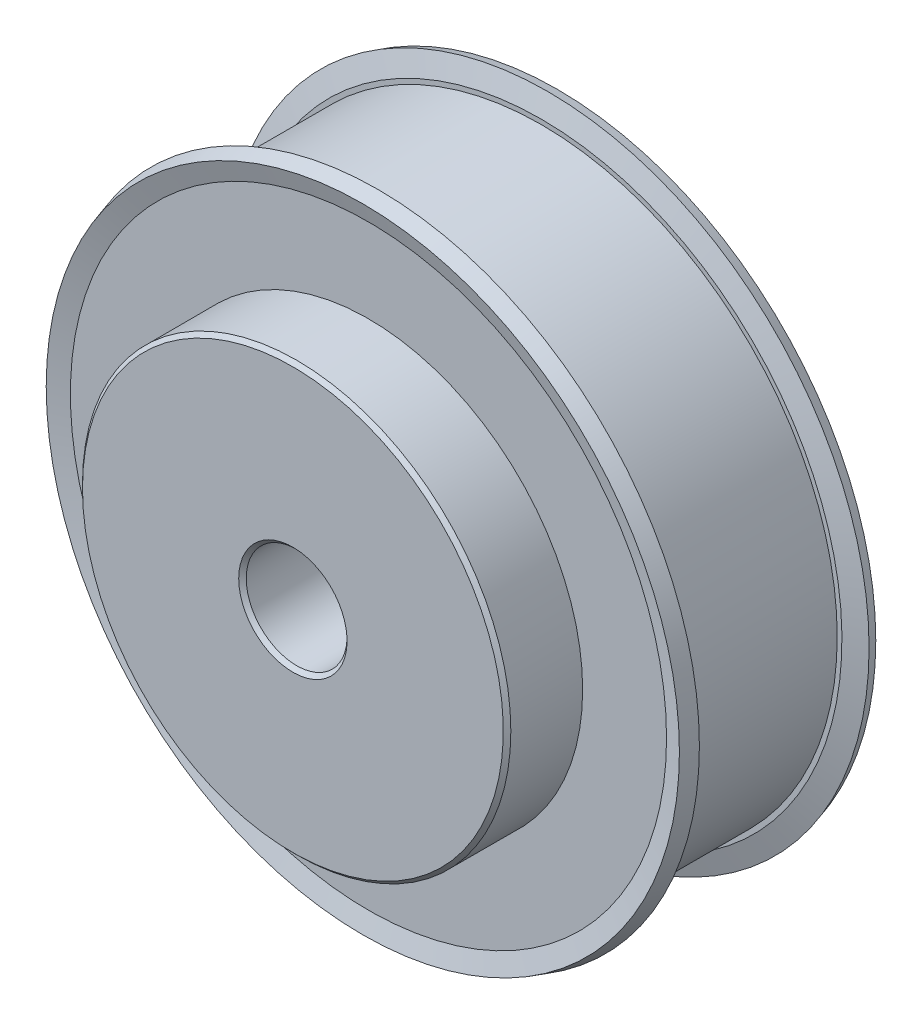
ISO-10303-21;
HEADER;
FILE_DESCRIPTION(('STEP AP214'),'2;1');
FILE_NAME('part.step','',(''),(''),'','','');
FILE_SCHEMA(('AUTOMOTIVE_DESIGN { 1 0 10303 214 1 1 1 1 }'));
ENDSEC;
DATA;
#1=APPLICATION_CONTEXT('core data for automotive mechanical design processes');
#2=APPLICATION_PROTOCOL_DEFINITION('international standard','automotive_design',2000,#1);
#3=PRODUCT_CONTEXT('',#1,'mechanical');
#4=PRODUCT('Part','Part','',(#3));
#5=PRODUCT_RELATED_PRODUCT_CATEGORY('part','',(#4));
#6=PRODUCT_DEFINITION_FORMATION('','',#4);
#7=PRODUCT_DEFINITION_CONTEXT('part definition',#1,'design');
#8=PRODUCT_DEFINITION('design','',#6,#7);
#9=PRODUCT_DEFINITION_SHAPE('','',#8);
#10=(LENGTH_UNIT() NAMED_UNIT(*) SI_UNIT(.MILLI.,.METRE.));
#11=(NAMED_UNIT(*) PLANE_ANGLE_UNIT() SI_UNIT($,.RADIAN.));
#12=(NAMED_UNIT(*) SI_UNIT($,.STERADIAN.) SOLID_ANGLE_UNIT());
#13=UNCERTAINTY_MEASURE_WITH_UNIT(LENGTH_MEASURE(1.E-05),#10,'distance_accuracy_value','');
#14=(GEOMETRIC_REPRESENTATION_CONTEXT(3) GLOBAL_UNCERTAINTY_ASSIGNED_CONTEXT((#13)) GLOBAL_UNIT_ASSIGNED_CONTEXT((#10,
#11,#12)) REPRESENTATION_CONTEXT('',''));
#15=CARTESIAN_POINT('',(0.,0.,0.));
#16=DIRECTION('',(0.,0.,1.));
#17=DIRECTION('',(1.,0.,0.));
#18=AXIS2_PLACEMENT_3D('',#15,#16,#17);
#19=CARTESIAN_POINT('',(0.,0.,-10.5047613550891));
#20=DIRECTION('',(0.,0.,1.));
#21=DIRECTION('',(1.,0.,0.));
#22=AXIS2_PLACEMENT_3D('',#19,#20,#21);
#23=CONICAL_SURFACE('',#22,25.4999999999972,0.296705972838979);
#24=CARTESIAN_POINT('',(0.,0.,-10.5047613550891));
#25=DIRECTION('',(0.,0.,1.));
#26=DIRECTION('',(1.,0.,0.));
#27=AXIS2_PLACEMENT_3D('',#24,#25,#26);
#28=CIRCLE('',#27,25.4999999999972);
#29=CARTESIAN_POINT('',(25.4999999999972,0.,-10.5047613550891));
#30=VERTEX_POINT('',#29);
#31=EDGE_CURVE('E107',#30,#30,#28,.F.);
#32=ORIENTED_EDGE('',*,*,#31,.T.);
#33=EDGE_LOOP('',(#32));
#34=FACE_BOUND('',#33,.T.);
#35=CARTESIAN_POINT('',(0.,0.,-11.27));
#36=DIRECTION('',(0.,0.,-1.));
#37=DIRECTION('',(-1.,0.,0.));
#38=AXIS2_PLACEMENT_3D('',#35,#36,#37);
#39=CIRCLE('',#38,25.2660430676101);
#40=CARTESIAN_POINT('',(-25.2660430676101,0.,-11.27));
#41=VERTEX_POINT('',#40);
#42=EDGE_CURVE('E100',#41,#41,#39,.F.);
#43=ORIENTED_EDGE('',*,*,#42,.T.);
#44=EDGE_LOOP('',(#43));
#45=FACE_BOUND('',#44,.T.);
#46=ADVANCED_FACE('F35',(#34,#45),#23,.T.);
#47=CARTESIAN_POINT('',(0.,0.,9.73));
#48=DIRECTION('',(0.,0.,-1.));
#49=DIRECTION('',(-1.,0.,0.));
#50=AXIS2_PLACEMENT_3D('',#47,#48,#49);
#51=CYLINDRICAL_SURFACE('',#50,4.);
#52=CARTESIAN_POINT('',(0.,0.,9.43000000000001));
#53=DIRECTION('',(0.,0.,-1.));
#54=DIRECTION('',(-1.,0.,0.));
#55=AXIS2_PLACEMENT_3D('',#52,#53,#54);
#56=CIRCLE('',#55,4.);
#57=CARTESIAN_POINT('',(-4.,0.,9.43000000000001));
#58=VERTEX_POINT('',#57);
#59=EDGE_CURVE('E110',#58,#58,#56,.F.);
#60=ORIENTED_EDGE('',*,*,#59,.T.);
#61=EDGE_LOOP('',(#60));
#62=FACE_BOUND('',#61,.T.);
#63=CARTESIAN_POINT('',(0.,0.,-7.27));
#64=DIRECTION('',(0.,0.,-1.));
#65=DIRECTION('',(-1.,0.,0.));
#66=AXIS2_PLACEMENT_3D('',#63,#64,#65);
#67=CIRCLE('',#66,4.);
#68=CARTESIAN_POINT('',(-4.,0.,-7.27));
#69=VERTEX_POINT('',#68);
#70=EDGE_CURVE('E106',#69,#69,#67,.F.);
#71=ORIENTED_EDGE('',*,*,#70,.F.);
#72=EDGE_LOOP('',(#71));
#73=FACE_BOUND('',#72,.T.);
#74=ADVANCED_FACE('F166',(#62,#73),#51,.F.);
#75=CARTESIAN_POINT('',(0.,0.,2.96476135508831));
#76=DIRECTION('',(0.,0.,1.));
#77=DIRECTION('',(0.,-1.,0.));
#78=AXIS2_PLACEMENT_3D('',#75,#76,#77);
#79=CONICAL_SURFACE('',#78,25.4999999999999,1.27409035395562);
#80=CARTESIAN_POINT('',(0.,0.,2.96476135508773));
#81=DIRECTION('',(0.,0.,-1.));
#82=DIRECTION('',(-1.,0.,0.));
#83=AXIS2_PLACEMENT_3D('',#80,#81,#82);
#84=CIRCLE('',#83,25.4999999999991);
#85=CARTESIAN_POINT('',(-25.4999999999991,0.,2.96476135508773));
#86=VERTEX_POINT('',#85);
#87=EDGE_CURVE('E117',#86,#86,#84,.F.);
#88=ORIENTED_EDGE('',*,*,#87,.F.);
#89=EDGE_LOOP('',(#88));
#90=FACE_BOUND('',#89,.T.);
#91=CARTESIAN_POINT('',(0.,0.,2.45999999999969));
#92=DIRECTION('',(0.,0.,1.));
#93=DIRECTION('',(0.,-1.,0.));
#94=AXIS2_PLACEMENT_3D('',#91,#92,#93);
#95=CIRCLE('',#94,23.8490000000001);
#96=CARTESIAN_POINT('',(0.,-23.8490000000001,2.45999999999969));
#97=VERTEX_POINT('',#96);
#98=EDGE_CURVE('E116',#97,#97,#95,.T.);
#99=ORIENTED_EDGE('',*,*,#98,.T.);
#100=EDGE_LOOP('',(#99));
#101=FACE_BOUND('',#100,.T.);
#102=ADVANCED_FACE('F172',(#90,#101),#79,.T.);
#103=CARTESIAN_POINT('',(0.,0.,2.96476135508774));
#104=DIRECTION('',(0.,0.,-1.));
#105=DIRECTION('',(-1.,0.,0.));
#106=AXIS2_PLACEMENT_3D('',#103,#104,#105);
#107=CONICAL_SURFACE('',#106,25.4999999999991,0.296705972838979);
#108=ORIENTED_EDGE('',*,*,#87,.T.);
#109=EDGE_LOOP('',(#108));
#110=FACE_BOUND('',#109,.T.);
#111=CARTESIAN_POINT('',(0.,0.,4.1792683951624));
#112=DIRECTION('',(0.,0.,1.));
#113=DIRECTION('',(1.,0.,0.));
#114=AXIS2_PLACEMENT_3D('',#111,#112,#113);
#115=CIRCLE('',#114,25.1286879349996);
#116=CARTESIAN_POINT('',(25.1286879349996,0.,4.1792683951624));
#117=VERTEX_POINT('',#116);
#118=EDGE_CURVE('E112',#117,#117,#115,.F.);
#119=ORIENTED_EDGE('',*,*,#118,.T.);
#120=EDGE_LOOP('',(#119));
#121=FACE_BOUND('',#120,.T.);
#122=ADVANCED_FACE('F208',(#110,#121),#107,.T.);
#123=CARTESIAN_POINT('',(1.517253185646,18.73,2.46));
#124=DIRECTION('',(0.,0.,1.));
#125=DIRECTION('',(1.,0.,0.));
#126=AXIS2_PLACEMENT_3D('',#123,#124,#125);
#127=PLANE('',#126);
#128=CARTESIAN_POINT('',(0.,0.,2.46));
#129=DIRECTION('',(0.,0.,-1.));
#130=DIRECTION('',(-1.,0.,0.));
#131=AXIS2_PLACEMENT_3D('',#128,#129,#130);
#132=CIRCLE('',#131,23.475);
#133=CARTESIAN_POINT('',(-23.475,0.,2.46));
#134=VERTEX_POINT('',#133);
#135=EDGE_CURVE('E115',#134,#134,#132,.T.);
#136=ORIENTED_EDGE('',*,*,#135,.F.);
#137=EDGE_LOOP('',(#136));
#138=FACE_BOUND('',#137,.T.);
#139=ORIENTED_EDGE('',*,*,#98,.F.);
#140=EDGE_LOOP('',(#139));
#141=FACE_BOUND('',#140,.T.);
#142=ADVANCED_FACE('F204',(#138,#141),#127,.F.);
#143=CARTESIAN_POINT('',(0.,0.,4.1792683951624));
#144=DIRECTION('',(0.,0.,1.));
#145=DIRECTION('',(1.,0.,0.));
#146=AXIS2_PLACEMENT_3D('',#143,#144,#145);
#147=CONICAL_SURFACE('',#146,25.1286879349996,1.27409035395562);
#148=ORIENTED_EDGE('',*,*,#118,.F.);
#149=EDGE_LOOP('',(#148));
#150=FACE_BOUND('',#149,.T.);
#151=CARTESIAN_POINT('',(0.,0.,3.73000000000231));
#152=DIRECTION('',(0.,0.,1.));
#153=DIRECTION('',(1.,0.,0.));
#154=AXIS2_PLACEMENT_3D('',#151,#152,#153);
#155=CIRCLE('',#154,23.6591972282893);
#156=CARTESIAN_POINT('',(23.6591972282893,0.,3.73000000000231));
#157=VERTEX_POINT('',#156);
#158=EDGE_CURVE('E125',#157,#157,#155,.F.);
#159=ORIENTED_EDGE('',*,*,#158,.T.);
#160=EDGE_LOOP('',(#159));
#161=FACE_BOUND('',#160,.T.);
#162=ADVANCED_FACE('F200',(#150,#161),#147,.F.);
#163=CARTESIAN_POINT('',(0.,0.,68.85732675342));
#164=DIRECTION('',(0.,0.,-1.));
#165=DIRECTION('',(-1.,0.,0.));
#166=AXIS2_PLACEMENT_3D('',#163,#164,#165);
#167=CYLINDRICAL_SURFACE('',#166,23.475);
#168=CARTESIAN_POINT('',(0.,0.,-9.99999999999999));
#169=DIRECTION('',(0.,0.,-1.));
#170=DIRECTION('',(-1.,0.,0.));
#171=AXIS2_PLACEMENT_3D('',#168,#169,#170);
#172=CIRCLE('',#171,23.475);
#173=CARTESIAN_POINT('',(-23.475,0.,-9.99999999999999));
#174=VERTEX_POINT('',#173);
#175=EDGE_CURVE('E128',#174,#174,#172,.T.);
#176=ORIENTED_EDGE('',*,*,#175,.F.);
#177=EDGE_LOOP('',(#176));
#178=FACE_BOUND('',#177,.T.);
#179=ORIENTED_EDGE('',*,*,#135,.T.);
#180=EDGE_LOOP('',(#179));
#181=FACE_BOUND('',#180,.T.);
#182=ADVANCED_FACE('F196',(#178,#181),#167,.T.);
#183=CARTESIAN_POINT('',(1.517253185646,18.73,-10.));
#184=DIRECTION('',(0.,0.,1.));
#185=DIRECTION('',(1.,0.,0.));
#186=AXIS2_PLACEMENT_3D('',#183,#184,#185);
#187=PLANE('',#186);
#188=ORIENTED_EDGE('',*,*,#175,.T.);
#189=EDGE_LOOP('',(#188));
#190=FACE_BOUND('',#189,.T.);
#191=CARTESIAN_POINT('',(0.,0.,-9.99999999999603));
#192=DIRECTION('',(0.,0.,-1.));
#193=DIRECTION('',(0.,1.,0.));
#194=AXIS2_PLACEMENT_3D('',#191,#192,#193);
#195=CIRCLE('',#194,23.8490000000012);
#196=CARTESIAN_POINT('',(0.,23.8490000000012,-9.99999999999603));
#197=VERTEX_POINT('',#196);
#198=EDGE_CURVE('E122',#197,#197,#195,.T.);
#199=ORIENTED_EDGE('',*,*,#198,.F.);
#200=EDGE_LOOP('',(#199));
#201=FACE_BOUND('',#200,.T.);
#202=ADVANCED_FACE('F192',(#190,#201),#187,.T.);
#203=CARTESIAN_POINT('',(0.,19.81019722829,3.73));
#204=DIRECTION('',(0.,0.,-1.));
#205=DIRECTION('',(-1.,0.,0.));
#206=AXIS2_PLACEMENT_3D('',#203,#204,#205);
#207=PLANE('',#206);
#208=CARTESIAN_POINT('',(0.,0.,3.73));
#209=DIRECTION('',(0.,0.,1.));
#210=DIRECTION('',(1.,0.,0.));
#211=AXIS2_PLACEMENT_3D('',#208,#209,#210);
#212=CIRCLE('',#211,17.);
#213=CARTESIAN_POINT('',(17.,0.,3.73));
#214=VERTEX_POINT('',#213);
#215=EDGE_CURVE('E111',#214,#214,#212,.T.);
#216=ORIENTED_EDGE('',*,*,#215,.F.);
#217=EDGE_LOOP('',(#216));
#218=FACE_BOUND('',#217,.T.);
#219=ORIENTED_EDGE('',*,*,#158,.F.);
#220=EDGE_LOOP('',(#219));
#221=FACE_BOUND('',#220,.T.);
#222=ADVANCED_FACE('F188',(#218,#221),#207,.F.);
#223=CARTESIAN_POINT('',(0.,0.,-10.5047613550848));
#224=DIRECTION('',(0.,0.,-1.));
#225=DIRECTION('',(0.,1.,0.));
#226=AXIS2_PLACEMENT_3D('',#223,#224,#225);
#227=CONICAL_SURFACE('',#226,25.5000000000016,1.27409035395562);
#228=ORIENTED_EDGE('',*,*,#31,.F.);
#229=EDGE_LOOP('',(#228));
#230=FACE_BOUND('',#229,.T.);
#231=ORIENTED_EDGE('',*,*,#198,.T.);
#232=EDGE_LOOP('',(#231));
#233=FACE_BOUND('',#232,.T.);
#234=ADVANCED_FACE('F184',(#230,#233),#227,.T.);
#235=CARTESIAN_POINT('',(0.,0.,0.));
#236=DIRECTION('',(0.,0.,1.));
#237=DIRECTION('',(1.,0.,0.));
#238=AXIS2_PLACEMENT_3D('',#235,#236,#237);
#239=CYLINDRICAL_SURFACE('',#238,17.);
#240=CARTESIAN_POINT('',(0.,0.,9.42999999999999));
#241=DIRECTION('',(0.,0.,-1.));
#242=DIRECTION('',(-1.,0.,0.));
#243=AXIS2_PLACEMENT_3D('',#240,#241,#242);
#244=CIRCLE('',#243,17.);
#245=CARTESIAN_POINT('',(-17.,0.,9.42999999999999));
#246=VERTEX_POINT('',#245);
#247=EDGE_CURVE('E137',#246,#246,#244,.T.);
#248=ORIENTED_EDGE('',*,*,#247,.T.);
#249=EDGE_LOOP('',(#248));
#250=FACE_BOUND('',#249,.T.);
#251=ORIENTED_EDGE('',*,*,#215,.T.);
#252=EDGE_LOOP('',(#251));
#253=FACE_BOUND('',#252,.T.);
#254=ADVANCED_FACE('F181',(#250,#253),#239,.T.);
#255=CARTESIAN_POINT('',(0.,0.,9.73));
#256=DIRECTION('',(0.,0.,-1.));
#257=DIRECTION('',(-1.,0.,0.));
#258=AXIS2_PLACEMENT_3D('',#255,#256,#257);
#259=PLANE('',#258);
#260=CARTESIAN_POINT('',(0.,0.,9.73));
#261=DIRECTION('',(0.,0.,-1.));
#262=DIRECTION('',(-1.,0.,0.));
#263=AXIS2_PLACEMENT_3D('',#260,#261,#262);
#264=CIRCLE('',#263,16.7);
#265=CARTESIAN_POINT('',(-16.7,0.,9.73));
#266=VERTEX_POINT('',#265);
#267=EDGE_CURVE('E143',#266,#266,#264,.F.);
#268=ORIENTED_EDGE('',*,*,#267,.T.);
#269=EDGE_LOOP('',(#268));
#270=FACE_BOUND('',#269,.T.);
#271=CARTESIAN_POINT('',(0.,0.,9.73));
#272=DIRECTION('',(0.,0.,-1.));
#273=DIRECTION('',(-1.,0.,0.));
#274=AXIS2_PLACEMENT_3D('',#271,#272,#273);
#275=CIRCLE('',#274,4.29999999999999);
#276=CARTESIAN_POINT('',(-4.29999999999999,0.,9.73));
#277=VERTEX_POINT('',#276);
#278=EDGE_CURVE('E140',#277,#277,#275,.T.);
#279=ORIENTED_EDGE('',*,*,#278,.T.);
#280=EDGE_LOOP('',(#279));
#281=FACE_BOUND('',#280,.T.);
#282=ADVANCED_FACE('F179',(#270,#281),#259,.F.);
#283=CARTESIAN_POINT('',(0.,19.81019722829,-11.27));
#284=DIRECTION('',(0.,0.,1.));
#285=DIRECTION('',(1.,0.,0.));
#286=AXIS2_PLACEMENT_3D('',#283,#284,#285);
#287=PLANE('',#286);
#288=CARTESIAN_POINT('',(11.4904851942814,11.4904851942814,-11.27));
#289=DIRECTION('',(0.,0.,-1.));
#290=DIRECTION('',(-1.,0.,0.));
#291=AXIS2_PLACEMENT_3D('',#288,#289,#290);
#292=CIRCLE('',#291,1.525);
#293=CARTESIAN_POINT('',(9.96548519428138,11.4904851942814,-11.27));
#294=VERTEX_POINT('',#293);
#295=EDGE_CURVE('E73',#294,#294,#292,.T.);
#296=ORIENTED_EDGE('',*,*,#295,.F.);
#297=EDGE_LOOP('',(#296));
#298=FACE_BOUND('',#297,.T.);
#299=CARTESIAN_POINT('',(-11.4904851942814,11.4904851942814,-11.27));
#300=DIRECTION('',(0.,0.,-1.));
#301=DIRECTION('',(-1.,0.,0.));
#302=AXIS2_PLACEMENT_3D('',#299,#300,#301);
#303=CIRCLE('',#302,1.525);
#304=CARTESIAN_POINT('',(-13.0154851942814,11.4904851942814,-11.27));
#305=VERTEX_POINT('',#304);
#306=EDGE_CURVE('E66',#305,#305,#303,.T.);
#307=ORIENTED_EDGE('',*,*,#306,.F.);
#308=EDGE_LOOP('',(#307));
#309=FACE_BOUND('',#308,.T.);
#310=CARTESIAN_POINT('',(-11.4904851942814,-11.4904851942814,-11.27));
#311=DIRECTION('',(0.,0.,-1.));
#312=DIRECTION('',(-1.,0.,0.));
#313=AXIS2_PLACEMENT_3D('',#310,#311,#312);
#314=CIRCLE('',#313,1.525);
#315=CARTESIAN_POINT('',(-13.0154851942814,-11.4904851942814,-11.27));
#316=VERTEX_POINT('',#315);
#317=EDGE_CURVE('E82',#316,#316,#314,.T.);
#318=ORIENTED_EDGE('',*,*,#317,.F.);
#319=EDGE_LOOP('',(#318));
#320=FACE_BOUND('',#319,.T.);
#321=CARTESIAN_POINT('',(11.4904851942814,-11.4904851942814,-11.27));
#322=DIRECTION('',(0.,0.,-1.));
#323=DIRECTION('',(-1.,0.,0.));
#324=AXIS2_PLACEMENT_3D('',#321,#322,#323);
#325=CIRCLE('',#324,1.525);
#326=CARTESIAN_POINT('',(9.96548519428138,-11.4904851942814,-11.27));
#327=VERTEX_POINT('',#326);
#328=EDGE_CURVE('E91',#327,#327,#325,.T.);
#329=ORIENTED_EDGE('',*,*,#328,.F.);
#330=EDGE_LOOP('',(#329));
#331=FACE_BOUND('',#330,.T.);
#332=CARTESIAN_POINT('',(0.,0.,-11.27));
#333=DIRECTION('',(0.,0.,1.));
#334=DIRECTION('',(1.,0.,0.));
#335=AXIS2_PLACEMENT_3D('',#332,#333,#334);
#336=CIRCLE('',#335,7.);
#337=CARTESIAN_POINT('',(7.,0.,-11.27));
#338=VERTEX_POINT('',#337);
#339=EDGE_CURVE('E12',#338,#338,#336,.T.);
#340=ORIENTED_EDGE('',*,*,#339,.T.);
#341=EDGE_LOOP('',(#340));
#342=FACE_BOUND('',#341,.T.);
#343=ORIENTED_EDGE('',*,*,#42,.F.);
#344=EDGE_LOOP('',(#343));
#345=FACE_BOUND('',#344,.T.);
#346=ADVANCED_FACE('F175',(#298,#309,#320,#331,#342,#345),#287,.F.);
#347=CARTESIAN_POINT('',(0.,0.,9.42999999999999));
#348=DIRECTION('',(0.,0.,-1.));
#349=DIRECTION('',(-1.,0.,0.));
#350=AXIS2_PLACEMENT_3D('',#347,#348,#349);
#351=CONICAL_SURFACE('',#350,17.,0.785398163397448);
#352=ORIENTED_EDGE('',*,*,#267,.F.);
#353=EDGE_LOOP('',(#352));
#354=FACE_BOUND('',#353,.T.);
#355=ORIENTED_EDGE('',*,*,#247,.F.);
#356=EDGE_LOOP('',(#355));
#357=FACE_BOUND('',#356,.T.);
#358=ADVANCED_FACE('F215',(#354,#357),#351,.T.);
#359=CARTESIAN_POINT('',(0.,0.,9.73));
#360=DIRECTION('',(0.,0.,1.));
#361=DIRECTION('',(1.,0.,0.));
#362=AXIS2_PLACEMENT_3D('',#359,#360,#361);
#363=CONICAL_SURFACE('',#362,4.29999999999999,0.785398163397451);
#364=ORIENTED_EDGE('',*,*,#59,.F.);
#365=EDGE_LOOP('',(#364));
#366=FACE_BOUND('',#365,.T.);
#367=ORIENTED_EDGE('',*,*,#278,.F.);
#368=EDGE_LOOP('',(#367));
#369=FACE_BOUND('',#368,.T.);
#370=ADVANCED_FACE('F218',(#366,#369),#363,.F.);
#371=CARTESIAN_POINT('',(0.,0.,-7.27));
#372=DIRECTION('',(0.,0.,-1.));
#373=DIRECTION('',(-1.,0.,0.));
#374=AXIS2_PLACEMENT_3D('',#371,#372,#373);
#375=PLANE('',#374);
#376=CARTESIAN_POINT('',(0.,0.,-7.27));
#377=DIRECTION('',(0.,0.,-1.));
#378=DIRECTION('',(-1.,0.,0.));
#379=AXIS2_PLACEMENT_3D('',#376,#377,#378);
#380=CIRCLE('',#379,6.5);
#381=CARTESIAN_POINT('',(-6.5,0.,-7.27));
#382=VERTEX_POINT('',#381);
#383=EDGE_CURVE('E103',#382,#382,#380,.T.);
#384=ORIENTED_EDGE('',*,*,#383,.T.);
#385=EDGE_LOOP('',(#384));
#386=FACE_BOUND('',#385,.T.);
#387=ORIENTED_EDGE('',*,*,#70,.T.);
#388=EDGE_LOOP('',(#387));
#389=FACE_BOUND('',#388,.T.);
#390=ADVANCED_FACE('F162',(#386,#389),#375,.T.);
#391=CARTESIAN_POINT('',(0.,0.,-7.27));
#392=DIRECTION('',(0.,0.,-1.));
#393=DIRECTION('',(-1.,0.,0.));
#394=AXIS2_PLACEMENT_3D('',#391,#392,#393);
#395=CYLINDRICAL_SURFACE('',#394,6.5);
#396=CARTESIAN_POINT('',(0.,0.,-10.77));
#397=DIRECTION('',(0.,0.,1.));
#398=DIRECTION('',(1.,0.,0.));
#399=AXIS2_PLACEMENT_3D('',#396,#397,#398);
#400=CIRCLE('',#399,6.5);
#401=CARTESIAN_POINT('',(6.5,0.,-10.77));
#402=VERTEX_POINT('',#401);
#403=EDGE_CURVE('E43',#402,#402,#400,.F.);
#404=ORIENTED_EDGE('',*,*,#403,.T.);
#405=EDGE_LOOP('',(#404));
#406=FACE_BOUND('',#405,.T.);
#407=ORIENTED_EDGE('',*,*,#383,.F.);
#408=EDGE_LOOP('',(#407));
#409=FACE_BOUND('',#408,.T.);
#410=ADVANCED_FACE('F150',(#406,#409),#395,.F.);
#411=CARTESIAN_POINT('',(0.,0.,-10.77));
#412=DIRECTION('',(0.,0.,1.));
#413=DIRECTION('',(1.,0.,0.));
#414=AXIS2_PLACEMENT_3D('',#411,#412,#413);
#415=TOROIDAL_SURFACE('',#414,7.,0.5);
#416=ORIENTED_EDGE('',*,*,#339,.F.);
#417=EDGE_LOOP('',(#416));
#418=FACE_BOUND('',#417,.T.);
#419=ORIENTED_EDGE('',*,*,#403,.F.);
#420=EDGE_LOOP('',(#419));
#421=FACE_BOUND('',#420,.T.);
#422=ADVANCED_FACE('F37',(#418,#421),#415,.T.);
#423=CARTESIAN_POINT('',(11.4904851942814,-11.4904851942814,-1.27));
#424=DIRECTION('',(0.,0.,-1.));
#425=DIRECTION('',(-1.,0.,0.));
#426=AXIS2_PLACEMENT_3D('',#423,#424,#425);
#427=CONICAL_SURFACE('',#426,1.25,1.02974425867665);
#428=CARTESIAN_POINT('',(11.4904851942814,-11.4904851942814,-0.518924226215548));
#429=VERTEX_POINT('',#428);
#430=VERTEX_LOOP('',#429);
#431=FACE_BOUND('',#430,.T.);
#432=CARTESIAN_POINT('',(11.4904851942814,-11.4904851942814,-1.27));
#433=DIRECTION('',(0.,0.,-1.));
#434=DIRECTION('',(-1.,0.,0.));
#435=AXIS2_PLACEMENT_3D('',#432,#433,#434);
#436=CIRCLE('',#435,1.25);
#437=CARTESIAN_POINT('',(10.2404851942814,-11.4904851942814,-1.27));
#438=VERTEX_POINT('',#437);
#439=EDGE_CURVE('E97',#438,#438,#436,.T.);
#440=ORIENTED_EDGE('',*,*,#439,.T.);
#441=EDGE_LOOP('',(#440));
#442=FACE_BOUND('',#441,.T.);
#443=ADVANCED_FACE('F154',(#431,#442),#427,.F.);
#444=CARTESIAN_POINT('',(11.4904851942814,-11.4904851942814,-11.27));
#445=DIRECTION('',(0.,0.,-1.));
#446=DIRECTION('',(-1.,0.,0.));
#447=AXIS2_PLACEMENT_3D('',#444,#445,#446);
#448=CYLINDRICAL_SURFACE('',#447,1.25);
#449=ORIENTED_EDGE('',*,*,#439,.F.);
#450=EDGE_LOOP('',(#449));
#451=FACE_BOUND('',#450,.T.);
#452=CARTESIAN_POINT('',(11.4904851942814,-11.4904851942814,-10.995));
#453=DIRECTION('',(0.,0.,-1.));
#454=DIRECTION('',(-1.,0.,0.));
#455=AXIS2_PLACEMENT_3D('',#452,#453,#454);
#456=CIRCLE('',#455,1.25);
#457=CARTESIAN_POINT('',(10.2404851942814,-11.4904851942814,-10.995));
#458=VERTEX_POINT('',#457);
#459=EDGE_CURVE('E94',#458,#458,#456,.T.);
#460=ORIENTED_EDGE('',*,*,#459,.T.);
#461=EDGE_LOOP('',(#460));
#462=FACE_BOUND('',#461,.T.);
#463=ADVANCED_FACE('F160',(#451,#462),#448,.F.);
#464=CARTESIAN_POINT('',(11.4904851942814,-11.4904851942814,-11.27));
#465=DIRECTION('',(0.,0.,-1.));
#466=DIRECTION('',(-1.,0.,0.));
#467=AXIS2_PLACEMENT_3D('',#464,#465,#466);
#468=CONICAL_SURFACE('',#467,1.525,0.785398163397445);
#469=ORIENTED_EDGE('',*,*,#459,.F.);
#470=EDGE_LOOP('',(#469));
#471=FACE_BOUND('',#470,.T.);
#472=ORIENTED_EDGE('',*,*,#328,.T.);
#473=EDGE_LOOP('',(#472));
#474=FACE_BOUND('',#473,.T.);
#475=ADVANCED_FACE('F252',(#471,#474),#468,.F.);
#476=CARTESIAN_POINT('',(-11.4904851942814,-11.4904851942814,-1.27));
#477=DIRECTION('',(0.,0.,-1.));
#478=DIRECTION('',(-1.,0.,0.));
#479=AXIS2_PLACEMENT_3D('',#476,#477,#478);
#480=CONICAL_SURFACE('',#479,1.25,1.02974425867665);
#481=CARTESIAN_POINT('',(-11.4904851942814,-11.4904851942814,-0.518924226215548));
#482=VERTEX_POINT('',#481);
#483=VERTEX_LOOP('',#482);
#484=FACE_BOUND('',#483,.T.);
#485=CARTESIAN_POINT('',(-11.4904851942814,-11.4904851942814,-1.27));
#486=DIRECTION('',(0.,0.,-1.));
#487=DIRECTION('',(-1.,0.,0.));
#488=AXIS2_PLACEMENT_3D('',#485,#486,#487);
#489=CIRCLE('',#488,1.25);
#490=CARTESIAN_POINT('',(-12.7404851942814,-11.4904851942814,-1.27));
#491=VERTEX_POINT('',#490);
#492=EDGE_CURVE('E88',#491,#491,#489,.T.);
#493=ORIENTED_EDGE('',*,*,#492,.T.);
#494=EDGE_LOOP('',(#493));
#495=FACE_BOUND('',#494,.T.);
#496=ADVANCED_FACE('F256',(#484,#495),#480,.F.);
#497=CARTESIAN_POINT('',(-11.4904851942814,-11.4904851942814,-11.27));
#498=DIRECTION('',(0.,0.,-1.));
#499=DIRECTION('',(-1.,0.,0.));
#500=AXIS2_PLACEMENT_3D('',#497,#498,#499);
#501=CYLINDRICAL_SURFACE('',#500,1.25);
#502=ORIENTED_EDGE('',*,*,#492,.F.);
#503=EDGE_LOOP('',(#502));
#504=FACE_BOUND('',#503,.T.);
#505=CARTESIAN_POINT('',(-11.4904851942814,-11.4904851942814,-10.995));
#506=DIRECTION('',(0.,0.,-1.));
#507=DIRECTION('',(-1.,0.,0.));
#508=AXIS2_PLACEMENT_3D('',#505,#506,#507);
#509=CIRCLE('',#508,1.25);
#510=CARTESIAN_POINT('',(-12.7404851942814,-11.4904851942814,-10.995));
#511=VERTEX_POINT('',#510);
#512=EDGE_CURVE('E85',#511,#511,#509,.T.);
#513=ORIENTED_EDGE('',*,*,#512,.T.);
#514=EDGE_LOOP('',(#513));
#515=FACE_BOUND('',#514,.T.);
#516=ADVANCED_FACE('F260',(#504,#515),#501,.F.);
#517=CARTESIAN_POINT('',(-11.4904851942814,-11.4904851942814,-11.27));
#518=DIRECTION('',(0.,0.,-1.));
#519=DIRECTION('',(-1.,0.,0.));
#520=AXIS2_PLACEMENT_3D('',#517,#518,#519);
#521=CONICAL_SURFACE('',#520,1.525,0.785398163397445);
#522=ORIENTED_EDGE('',*,*,#512,.F.);
#523=EDGE_LOOP('',(#522));
#524=FACE_BOUND('',#523,.T.);
#525=ORIENTED_EDGE('',*,*,#317,.T.);
#526=EDGE_LOOP('',(#525));
#527=FACE_BOUND('',#526,.T.);
#528=ADVANCED_FACE('F263',(#524,#527),#521,.F.);
#529=CARTESIAN_POINT('',(-11.4904851942814,11.4904851942814,-1.27));
#530=DIRECTION('',(0.,0.,-1.));
#531=DIRECTION('',(-1.,0.,0.));
#532=AXIS2_PLACEMENT_3D('',#529,#530,#531);
#533=CONICAL_SURFACE('',#532,1.25,1.02974425867665);
#534=CARTESIAN_POINT('',(-11.4904851942814,11.4904851942814,-0.518924226215548));
#535=VERTEX_POINT('',#534);
#536=VERTEX_LOOP('',#535);
#537=FACE_BOUND('',#536,.T.);
#538=CARTESIAN_POINT('',(-11.4904851942814,11.4904851942814,-1.27));
#539=DIRECTION('',(0.,0.,-1.));
#540=DIRECTION('',(-1.,0.,0.));
#541=AXIS2_PLACEMENT_3D('',#538,#539,#540);
#542=CIRCLE('',#541,1.25);
#543=CARTESIAN_POINT('',(-12.7404851942814,11.4904851942814,-1.27));
#544=VERTEX_POINT('',#543);
#545=EDGE_CURVE('E79',#544,#544,#542,.T.);
#546=ORIENTED_EDGE('',*,*,#545,.T.);
#547=EDGE_LOOP('',(#546));
#548=FACE_BOUND('',#547,.T.);
#549=ADVANCED_FACE('F267',(#537,#548),#533,.F.);
#550=CARTESIAN_POINT('',(-11.4904851942814,11.4904851942814,-11.27));
#551=DIRECTION('',(0.,0.,-1.));
#552=DIRECTION('',(-1.,0.,0.));
#553=AXIS2_PLACEMENT_3D('',#550,#551,#552);
#554=CYLINDRICAL_SURFACE('',#553,1.25);
#555=ORIENTED_EDGE('',*,*,#545,.F.);
#556=EDGE_LOOP('',(#555));
#557=FACE_BOUND('',#556,.T.);
#558=CARTESIAN_POINT('',(-11.4904851942814,11.4904851942814,-10.995));
#559=DIRECTION('',(0.,0.,-1.));
#560=DIRECTION('',(-1.,0.,0.));
#561=AXIS2_PLACEMENT_3D('',#558,#559,#560);
#562=CIRCLE('',#561,1.25);
#563=CARTESIAN_POINT('',(-12.7404851942814,11.4904851942814,-10.995));
#564=VERTEX_POINT('',#563);
#565=EDGE_CURVE('E70',#564,#564,#562,.T.);
#566=ORIENTED_EDGE('',*,*,#565,.T.);
#567=EDGE_LOOP('',(#566));
#568=FACE_BOUND('',#567,.T.);
#569=ADVANCED_FACE('F271',(#557,#568),#554,.F.);
#570=CARTESIAN_POINT('',(-11.4904851942814,11.4904851942814,-11.27));
#571=DIRECTION('',(0.,0.,-1.));
#572=DIRECTION('',(-1.,0.,0.));
#573=AXIS2_PLACEMENT_3D('',#570,#571,#572);
#574=CONICAL_SURFACE('',#573,1.525,0.785398163397445);
#575=ORIENTED_EDGE('',*,*,#565,.F.);
#576=EDGE_LOOP('',(#575));
#577=FACE_BOUND('',#576,.T.);
#578=ORIENTED_EDGE('',*,*,#306,.T.);
#579=EDGE_LOOP('',(#578));
#580=FACE_BOUND('',#579,.T.);
#581=ADVANCED_FACE('F60',(#577,#580),#574,.F.);
#582=CARTESIAN_POINT('',(11.4904851942814,11.4904851942814,-1.27));
#583=DIRECTION('',(0.,0.,-1.));
#584=DIRECTION('',(-1.,0.,0.));
#585=AXIS2_PLACEMENT_3D('',#582,#583,#584);
#586=CONICAL_SURFACE('',#585,1.25,1.02974425867665);
#587=CARTESIAN_POINT('',(11.4904851942814,11.4904851942814,-0.518924226215548));
#588=VERTEX_POINT('',#587);
#589=VERTEX_LOOP('',#588);
#590=FACE_BOUND('',#589,.T.);
#591=CARTESIAN_POINT('',(11.4904851942814,11.4904851942814,-1.27));
#592=DIRECTION('',(0.,0.,-1.));
#593=DIRECTION('',(-1.,0.,0.));
#594=AXIS2_PLACEMENT_3D('',#591,#592,#593);
#595=CIRCLE('',#594,1.25);
#596=CARTESIAN_POINT('',(10.2404851942814,11.4904851942814,-1.27));
#597=VERTEX_POINT('',#596);
#598=EDGE_CURVE('E64',#597,#597,#595,.T.);
#599=ORIENTED_EDGE('',*,*,#598,.T.);
#600=EDGE_LOOP('',(#599));
#601=FACE_BOUND('',#600,.T.);
#602=ADVANCED_FACE('F56',(#590,#601),#586,.F.);
#603=CARTESIAN_POINT('',(11.4904851942814,11.4904851942814,-11.27));
#604=DIRECTION('',(0.,0.,-1.));
#605=DIRECTION('',(-1.,0.,0.));
#606=AXIS2_PLACEMENT_3D('',#603,#604,#605);
#607=CYLINDRICAL_SURFACE('',#606,1.25);
#608=ORIENTED_EDGE('',*,*,#598,.F.);
#609=EDGE_LOOP('',(#608));
#610=FACE_BOUND('',#609,.T.);
#611=CARTESIAN_POINT('',(11.4904851942814,11.4904851942814,-10.995));
#612=DIRECTION('',(0.,0.,-1.));
#613=DIRECTION('',(-1.,0.,0.));
#614=AXIS2_PLACEMENT_3D('',#611,#612,#613);
#615=CIRCLE('',#614,1.25);
#616=CARTESIAN_POINT('',(10.2404851942814,11.4904851942814,-10.995));
#617=VERTEX_POINT('',#616);
#618=EDGE_CURVE('E67',#617,#617,#615,.T.);
#619=ORIENTED_EDGE('',*,*,#618,.T.);
#620=EDGE_LOOP('',(#619));
#621=FACE_BOUND('',#620,.T.);
#622=ADVANCED_FACE('F59',(#610,#621),#607,.F.);
#623=CARTESIAN_POINT('',(11.4904851942814,11.4904851942814,-11.27));
#624=DIRECTION('',(0.,0.,-1.));
#625=DIRECTION('',(-1.,0.,0.));
#626=AXIS2_PLACEMENT_3D('',#623,#624,#625);
#627=CONICAL_SURFACE('',#626,1.525,0.785398163397445);
#628=ORIENTED_EDGE('',*,*,#618,.F.);
#629=EDGE_LOOP('',(#628));
#630=FACE_BOUND('',#629,.T.);
#631=ORIENTED_EDGE('',*,*,#295,.T.);
#632=EDGE_LOOP('',(#631));
#633=FACE_BOUND('',#632,.T.);
#634=ADVANCED_FACE('F281',(#630,#633),#627,.F.);
#635=CLOSED_SHELL('',(#46,#74,#102,#122,#142,#162,#182,#202,#222,#234,#254,#282,#346,#358,#370,
#390,#410,#422,#443,#463,#475,#496,#516,#528,#549,#569,#581,#602,#622,#634));
#636=MANIFOLD_SOLID_BREP('B2',#635);
#637=ADVANCED_BREP_SHAPE_REPRESENTATION('',(#18,#636),#14);
#638=SHAPE_DEFINITION_REPRESENTATION(#9,#637);
ENDSEC;
END-ISO-10303-21;
